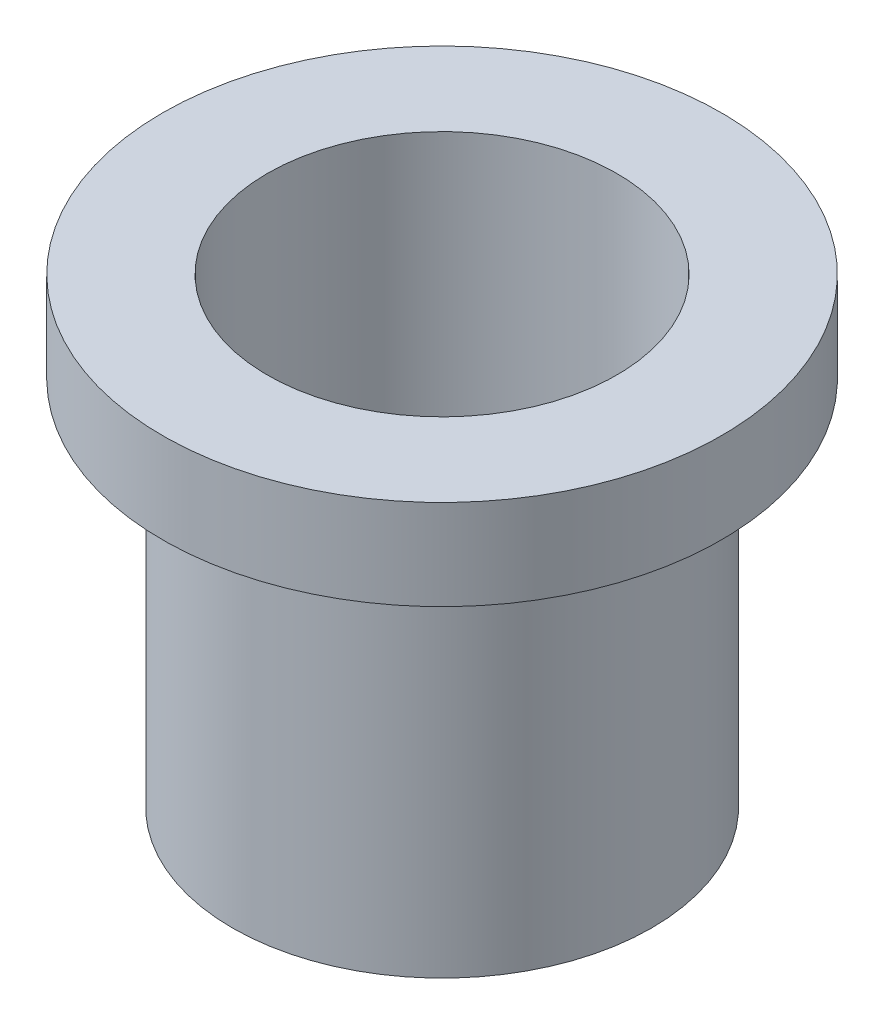
ISO-10303-21;
HEADER;
FILE_DESCRIPTION(('STEP AP214'),'2;1');
FILE_NAME('part.step','',(''),(''),'','','');
FILE_SCHEMA(('AUTOMOTIVE_DESIGN { 1 0 10303 214 1 1 1 1 }'));
ENDSEC;
DATA;
#1=APPLICATION_CONTEXT('core data for automotive mechanical design processes');
#2=APPLICATION_PROTOCOL_DEFINITION('international standard','automotive_design',2000,#1);
#3=PRODUCT_CONTEXT('',#1,'mechanical');
#4=PRODUCT('Part','Part','',(#3));
#5=PRODUCT_RELATED_PRODUCT_CATEGORY('part','',(#4));
#6=PRODUCT_DEFINITION_FORMATION('','',#4);
#7=PRODUCT_DEFINITION_CONTEXT('part definition',#1,'design');
#8=PRODUCT_DEFINITION('design','',#6,#7);
#9=PRODUCT_DEFINITION_SHAPE('','',#8);
#10=(LENGTH_UNIT() NAMED_UNIT(*) SI_UNIT(.MILLI.,.METRE.));
#11=(NAMED_UNIT(*) PLANE_ANGLE_UNIT() SI_UNIT($,.RADIAN.));
#12=(NAMED_UNIT(*) SI_UNIT($,.STERADIAN.) SOLID_ANGLE_UNIT());
#13=UNCERTAINTY_MEASURE_WITH_UNIT(LENGTH_MEASURE(1.E-05),#10,'distance_accuracy_value','');
#14=(GEOMETRIC_REPRESENTATION_CONTEXT(3) GLOBAL_UNCERTAINTY_ASSIGNED_CONTEXT((#13)) GLOBAL_UNIT_ASSIGNED_CONTEXT((#10,
#11,#12)) REPRESENTATION_CONTEXT('',''));
#15=CARTESIAN_POINT('',(0.,0.,0.));
#16=DIRECTION('',(0.,0.,1.));
#17=DIRECTION('',(1.,0.,0.));
#18=AXIS2_PLACEMENT_3D('',#15,#16,#17);
#19=CARTESIAN_POINT('',(0.,35.765798189327,0.));
#20=DIRECTION('',(0.,1.,0.));
#21=DIRECTION('',(-1.,0.,0.));
#22=AXIS2_PLACEMENT_3D('',#19,#20,#21);
#23=CYLINDRICAL_SURFACE('',#22,9.525);
#24=CARTESIAN_POINT('',(0.,0.,0.));
#25=DIRECTION('',(0.,1.,0.));
#26=DIRECTION('',(-1.,0.,0.));
#27=AXIS2_PLACEMENT_3D('',#24,#25,#26);
#28=CIRCLE('',#27,9.525);
#29=CARTESIAN_POINT('',(-9.525,0.,0.));
#30=VERTEX_POINT('',#29);
#31=EDGE_CURVE('E52',#30,#30,#28,.T.);
#32=ORIENTED_EDGE('',*,*,#31,.F.);
#33=EDGE_LOOP('',(#32));
#34=FACE_BOUND('',#33,.T.);
#35=CARTESIAN_POINT('',(0.,-16.86,0.));
#36=DIRECTION('',(0.,1.,0.));
#37=DIRECTION('',(-1.,0.,0.));
#38=AXIS2_PLACEMENT_3D('',#35,#36,#37);
#39=CIRCLE('',#38,9.525);
#40=CARTESIAN_POINT('',(-9.525,-16.86,0.));
#41=VERTEX_POINT('',#40);
#42=EDGE_CURVE('E10',#41,#41,#39,.T.);
#43=ORIENTED_EDGE('',*,*,#42,.T.);
#44=EDGE_LOOP('',(#43));
#45=FACE_BOUND('',#44,.T.);
#46=ADVANCED_FACE('F30',(#34,#45),#23,.T.);
#47=CARTESIAN_POINT('',(7.93750000000001,-16.86,0.));
#48=DIRECTION('',(0.,1.,0.));
#49=DIRECTION('',(-1.,0.,0.));
#50=AXIS2_PLACEMENT_3D('',#47,#48,#49);
#51=PLANE('',#50);
#52=ORIENTED_EDGE('',*,*,#42,.F.);
#53=EDGE_LOOP('',(#52));
#54=FACE_BOUND('',#53,.T.);
#55=CARTESIAN_POINT('',(0.,-16.86,0.));
#56=DIRECTION('',(0.,1.,0.));
#57=DIRECTION('',(-1.,0.,0.));
#58=AXIS2_PLACEMENT_3D('',#55,#56,#57);
#59=CIRCLE('',#58,7.93750000000001);
#60=CARTESIAN_POINT('',(-7.9375,-16.86,0.));
#61=VERTEX_POINT('',#60);
#62=EDGE_CURVE('E36',#61,#61,#59,.T.);
#63=ORIENTED_EDGE('',*,*,#62,.T.);
#64=EDGE_LOOP('',(#63));
#65=FACE_BOUND('',#64,.T.);
#66=ADVANCED_FACE('F59',(#54,#65),#51,.F.);
#67=CARTESIAN_POINT('',(0.,35.765798189327,0.));
#68=DIRECTION('',(0.,1.,0.));
#69=DIRECTION('',(-1.,0.,0.));
#70=AXIS2_PLACEMENT_3D('',#67,#68,#69);
#71=CYLINDRICAL_SURFACE('',#70,7.9375);
#72=ORIENTED_EDGE('',*,*,#62,.F.);
#73=EDGE_LOOP('',(#72));
#74=FACE_BOUND('',#73,.T.);
#75=CARTESIAN_POINT('',(0.,4.1,0.));
#76=DIRECTION('',(0.,1.,0.));
#77=DIRECTION('',(-1.,0.,0.));
#78=AXIS2_PLACEMENT_3D('',#75,#76,#77);
#79=CIRCLE('',#78,7.9375);
#80=CARTESIAN_POINT('',(-7.9375,4.1,0.));
#81=VERTEX_POINT('',#80);
#82=EDGE_CURVE('E40',#81,#81,#79,.T.);
#83=ORIENTED_EDGE('',*,*,#82,.T.);
#84=EDGE_LOOP('',(#83));
#85=FACE_BOUND('',#84,.T.);
#86=ADVANCED_FACE('F63',(#74,#85),#71,.F.);
#87=CARTESIAN_POINT('',(12.7,4.1,0.));
#88=DIRECTION('',(0.,-1.,0.));
#89=DIRECTION('',(1.,0.,0.));
#90=AXIS2_PLACEMENT_3D('',#87,#88,#89);
#91=PLANE('',#90);
#92=ORIENTED_EDGE('',*,*,#82,.F.);
#93=EDGE_LOOP('',(#92));
#94=FACE_BOUND('',#93,.T.);
#95=CARTESIAN_POINT('',(0.,4.1,0.));
#96=DIRECTION('',(0.,1.,0.));
#97=DIRECTION('',(-1.,0.,0.));
#98=AXIS2_PLACEMENT_3D('',#95,#96,#97);
#99=CIRCLE('',#98,12.7);
#100=CARTESIAN_POINT('',(-12.7,4.1,0.));
#101=VERTEX_POINT('',#100);
#102=EDGE_CURVE('E44',#101,#101,#99,.T.);
#103=ORIENTED_EDGE('',*,*,#102,.T.);
#104=EDGE_LOOP('',(#103));
#105=FACE_BOUND('',#104,.T.);
#106=ADVANCED_FACE('F68',(#94,#105),#91,.F.);
#107=CARTESIAN_POINT('',(0.,35.765798189327,0.));
#108=DIRECTION('',(0.,1.,0.));
#109=DIRECTION('',(-1.,0.,0.));
#110=AXIS2_PLACEMENT_3D('',#107,#108,#109);
#111=CYLINDRICAL_SURFACE('',#110,12.7);
#112=ORIENTED_EDGE('',*,*,#102,.F.);
#113=EDGE_LOOP('',(#112));
#114=FACE_BOUND('',#113,.T.);
#115=CARTESIAN_POINT('',(0.,0.,0.));
#116=DIRECTION('',(0.,1.,0.));
#117=DIRECTION('',(-1.,0.,0.));
#118=AXIS2_PLACEMENT_3D('',#115,#116,#117);
#119=CIRCLE('',#118,12.7);
#120=CARTESIAN_POINT('',(-12.7,0.,0.));
#121=VERTEX_POINT('',#120);
#122=EDGE_CURVE('E49',#121,#121,#119,.T.);
#123=ORIENTED_EDGE('',*,*,#122,.T.);
#124=EDGE_LOOP('',(#123));
#125=FACE_BOUND('',#124,.T.);
#126=ADVANCED_FACE('F74',(#114,#125),#111,.T.);
#127=CARTESIAN_POINT('',(9.52500000000001,0.,0.));
#128=DIRECTION('',(0.,1.,0.));
#129=DIRECTION('',(-1.,0.,0.));
#130=AXIS2_PLACEMENT_3D('',#127,#128,#129);
#131=PLANE('',#130);
#132=ORIENTED_EDGE('',*,*,#122,.F.);
#133=EDGE_LOOP('',(#132));
#134=FACE_BOUND('',#133,.T.);
#135=ORIENTED_EDGE('',*,*,#31,.T.);
#136=EDGE_LOOP('',(#135));
#137=FACE_BOUND('',#136,.T.);
#138=ADVANCED_FACE('F56',(#134,#137),#131,.F.);
#139=CLOSED_SHELL('',(#46,#66,#86,#106,#126,#138));
#140=MANIFOLD_SOLID_BREP('B2',#139);
#141=ADVANCED_BREP_SHAPE_REPRESENTATION('',(#18,#140),#14);
#142=SHAPE_DEFINITION_REPRESENTATION(#9,#141);
ENDSEC;
END-ISO-10303-21;
